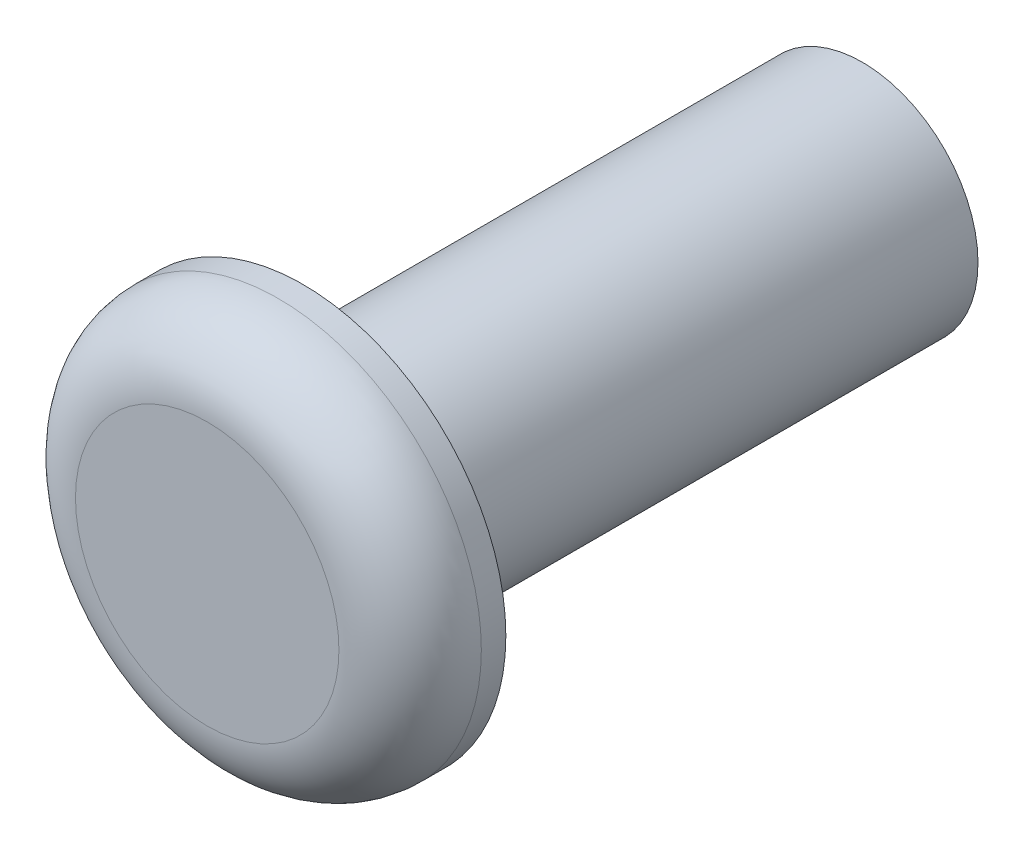
ISO-10303-21;
HEADER;
FILE_DESCRIPTION(('STEP AP214'),'2;1');
FILE_NAME('part.step','',(''),(''),'','','');
FILE_SCHEMA(('AUTOMOTIVE_DESIGN { 1 0 10303 214 1 1 1 1 }'));
ENDSEC;
DATA;
#1=APPLICATION_CONTEXT('core data for automotive mechanical design processes');
#2=APPLICATION_PROTOCOL_DEFINITION('international standard','automotive_design',2000,#1);
#3=PRODUCT_CONTEXT('',#1,'mechanical');
#4=PRODUCT('Part','Part','',(#3));
#5=PRODUCT_RELATED_PRODUCT_CATEGORY('part','',(#4));
#6=PRODUCT_DEFINITION_FORMATION('','',#4);
#7=PRODUCT_DEFINITION_CONTEXT('part definition',#1,'design');
#8=PRODUCT_DEFINITION('design','',#6,#7);
#9=PRODUCT_DEFINITION_SHAPE('','',#8);
#10=(LENGTH_UNIT() NAMED_UNIT(*) SI_UNIT(.MILLI.,.METRE.));
#11=(NAMED_UNIT(*) PLANE_ANGLE_UNIT() SI_UNIT($,.RADIAN.));
#12=(NAMED_UNIT(*) SI_UNIT($,.STERADIAN.) SOLID_ANGLE_UNIT());
#13=UNCERTAINTY_MEASURE_WITH_UNIT(LENGTH_MEASURE(1.E-05),#10,'distance_accuracy_value','');
#14=(GEOMETRIC_REPRESENTATION_CONTEXT(3) GLOBAL_UNCERTAINTY_ASSIGNED_CONTEXT((#13)) GLOBAL_UNIT_ASSIGNED_CONTEXT((#10,
#11,#12)) REPRESENTATION_CONTEXT('',''));
#15=CARTESIAN_POINT('',(0.,0.,0.));
#16=DIRECTION('',(0.,0.,1.));
#17=DIRECTION('',(1.,0.,0.));
#18=AXIS2_PLACEMENT_3D('',#15,#16,#17);
#19=CARTESIAN_POINT('',(0.,0.,0.));
#20=DIRECTION('',(0.,0.,-1.));
#21=DIRECTION('',(-1.,0.,0.));
#22=AXIS2_PLACEMENT_3D('',#19,#20,#21);
#23=PLANE('',#22);
#24=CARTESIAN_POINT('',(0.,0.,0.));
#25=DIRECTION('',(0.,0.,1.));
#26=DIRECTION('',(1.,0.,0.));
#27=AXIS2_PLACEMENT_3D('',#24,#25,#26);
#28=CIRCLE('',#27,0.939799999999996);
#29=CARTESIAN_POINT('',(0.939799999999996,0.,0.));
#30=VERTEX_POINT('',#29);
#31=EDGE_CURVE('E10',#30,#30,#28,.T.);
#32=ORIENTED_EDGE('',*,*,#31,.T.);
#33=EDGE_LOOP('',(#32));
#34=FACE_BOUND('',#33,.T.);
#35=ADVANCED_FACE('F34',(#34),#23,.F.);
#36=CARTESIAN_POINT('',(0.,0.,-0.508));
#37=DIRECTION('',(0.,0.,1.));
#38=DIRECTION('',(1.,0.,0.));
#39=AXIS2_PLACEMENT_3D('',#36,#37,#38);
#40=TOROIDAL_SURFACE('',#39,0.939799999999999,0.508);
#41=ORIENTED_EDGE('',*,*,#31,.F.);
#42=EDGE_LOOP('',(#41));
#43=FACE_BOUND('',#42,.T.);
#44=CARTESIAN_POINT('',(0.,0.,-0.508000000000002));
#45=DIRECTION('',(0.,0.,1.));
#46=DIRECTION('',(1.,0.,0.));
#47=AXIS2_PLACEMENT_3D('',#44,#45,#46);
#48=CIRCLE('',#47,1.4478);
#49=CARTESIAN_POINT('',(1.4478,0.,-0.508000000000002));
#50=VERTEX_POINT('',#49);
#51=EDGE_CURVE('E40',#50,#50,#48,.T.);
#52=ORIENTED_EDGE('',*,*,#51,.T.);
#53=EDGE_LOOP('',(#52));
#54=FACE_BOUND('',#53,.T.);
#55=ADVANCED_FACE('F69',(#43,#54),#40,.T.);
#56=CARTESIAN_POINT('',(0.,0.,43.0288168684613));
#57=DIRECTION('',(0.,0.,1.));
#58=DIRECTION('',(1.,0.,0.));
#59=AXIS2_PLACEMENT_3D('',#56,#57,#58);
#60=CYLINDRICAL_SURFACE('',#59,1.4478);
#61=ORIENTED_EDGE('',*,*,#51,.F.);
#62=EDGE_LOOP('',(#61));
#63=FACE_BOUND('',#62,.T.);
#64=CARTESIAN_POINT('',(0.,0.,-0.682863214691076));
#65=DIRECTION('',(0.,0.,1.));
#66=DIRECTION('',(1.,0.,0.));
#67=AXIS2_PLACEMENT_3D('',#64,#65,#66);
#68=CIRCLE('',#67,1.4478);
#69=CARTESIAN_POINT('',(1.4478,0.,-0.682863214691076));
#70=VERTEX_POINT('',#69);
#71=EDGE_CURVE('E44',#70,#70,#68,.T.);
#72=ORIENTED_EDGE('',*,*,#71,.T.);
#73=EDGE_LOOP('',(#72));
#74=FACE_BOUND('',#73,.T.);
#75=ADVANCED_FACE('F73',(#63,#74),#60,.T.);
#76=CARTESIAN_POINT('',(0.,1.4478,-0.682863214691073));
#77=DIRECTION('',(0.,0.,1.));
#78=DIRECTION('',(1.,0.,0.));
#79=AXIS2_PLACEMENT_3D('',#76,#77,#78);
#80=PLANE('',#79);
#81=ORIENTED_EDGE('',*,*,#71,.F.);
#82=EDGE_LOOP('',(#81));
#83=FACE_BOUND('',#82,.T.);
#84=CARTESIAN_POINT('',(0.,0.,-0.682863214691076));
#85=DIRECTION('',(0.,0.,1.));
#86=DIRECTION('',(1.,0.,0.));
#87=AXIS2_PLACEMENT_3D('',#84,#85,#86);
#88=CIRCLE('',#87,0.825499999999999);
#89=CARTESIAN_POINT('',(0.825499999999999,0.,-0.682863214691076));
#90=VERTEX_POINT('',#89);
#91=EDGE_CURVE('E48',#90,#90,#88,.T.);
#92=ORIENTED_EDGE('',*,*,#91,.T.);
#93=EDGE_LOOP('',(#92));
#94=FACE_BOUND('',#93,.T.);
#95=ADVANCED_FACE('F65',(#83,#94),#80,.F.);
#96=CARTESIAN_POINT('',(0.,0.,43.0288168684613));
#97=DIRECTION('',(0.,0.,1.));
#98=DIRECTION('',(1.,0.,0.));
#99=AXIS2_PLACEMENT_3D('',#96,#97,#98);
#100=CYLINDRICAL_SURFACE('',#99,0.825499999999999);
#101=ORIENTED_EDGE('',*,*,#91,.F.);
#102=EDGE_LOOP('',(#101));
#103=FACE_BOUND('',#102,.T.);
#104=CARTESIAN_POINT('',(0.,0.,-4.6736));
#105=DIRECTION('',(0.,0.,1.));
#106=DIRECTION('',(1.,0.,0.));
#107=AXIS2_PLACEMENT_3D('',#104,#105,#106);
#108=CIRCLE('',#107,0.825499999999999);
#109=CARTESIAN_POINT('',(0.825499999999999,0.,-4.6736));
#110=VERTEX_POINT('',#109);
#111=EDGE_CURVE('E53',#110,#110,#108,.T.);
#112=ORIENTED_EDGE('',*,*,#111,.T.);
#113=EDGE_LOOP('',(#112));
#114=FACE_BOUND('',#113,.T.);
#115=ADVANCED_FACE('F57',(#103,#114),#100,.T.);
#116=CARTESIAN_POINT('',(0.,0.825499999999999,-4.6736));
#117=DIRECTION('',(0.,0.,1.));
#118=DIRECTION('',(1.,0.,0.));
#119=AXIS2_PLACEMENT_3D('',#116,#117,#118);
#120=PLANE('',#119);
#121=ORIENTED_EDGE('',*,*,#111,.F.);
#122=EDGE_LOOP('',(#121));
#123=FACE_BOUND('',#122,.T.);
#124=ADVANCED_FACE('F59',(#123),#120,.F.);
#125=CLOSED_SHELL('',(#35,#55,#75,#95,#115,#124));
#126=MANIFOLD_SOLID_BREP('B2',#125);
#127=ADVANCED_BREP_SHAPE_REPRESENTATION('',(#18,#126),#14);
#128=SHAPE_DEFINITION_REPRESENTATION(#9,#127);
ENDSEC;
END-ISO-10303-21;
